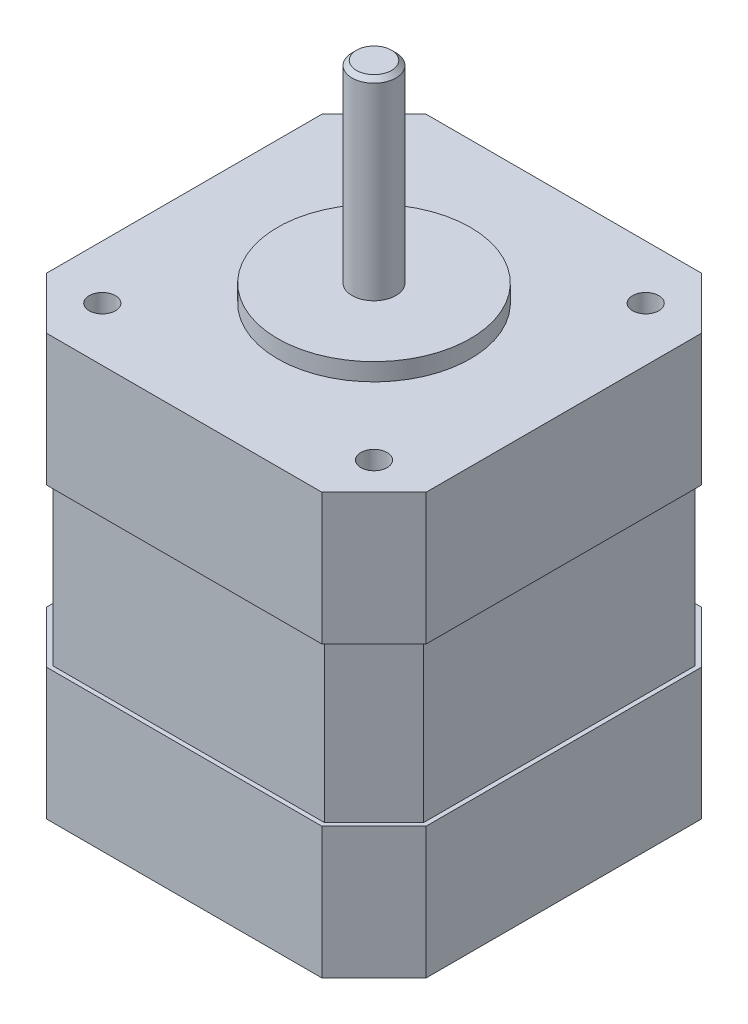
ISO-10303-21;
HEADER;
FILE_DESCRIPTION(('STEP AP214'),'2;1');
FILE_NAME('part.step','',(''),(''),'','','');
FILE_SCHEMA(('AUTOMOTIVE_DESIGN { 1 0 10303 214 1 1 1 1 }'));
ENDSEC;
DATA;
#1=APPLICATION_CONTEXT('core data for automotive mechanical design processes');
#2=APPLICATION_PROTOCOL_DEFINITION('international standard','automotive_design',2000,#1);
#3=PRODUCT_CONTEXT('',#1,'mechanical');
#4=PRODUCT('Part','Part','',(#3));
#5=PRODUCT_RELATED_PRODUCT_CATEGORY('part','',(#4));
#6=PRODUCT_DEFINITION_FORMATION('','',#4);
#7=PRODUCT_DEFINITION_CONTEXT('part definition',#1,'design');
#8=PRODUCT_DEFINITION('design','',#6,#7);
#9=PRODUCT_DEFINITION_SHAPE('','',#8);
#10=(LENGTH_UNIT() NAMED_UNIT(*) SI_UNIT(.MILLI.,.METRE.));
#11=(NAMED_UNIT(*) PLANE_ANGLE_UNIT() SI_UNIT($,.RADIAN.));
#12=(NAMED_UNIT(*) SI_UNIT($,.STERADIAN.) SOLID_ANGLE_UNIT());
#13=UNCERTAINTY_MEASURE_WITH_UNIT(LENGTH_MEASURE(1.E-05),#10,'distance_accuracy_value','');
#14=(GEOMETRIC_REPRESENTATION_CONTEXT(3) GLOBAL_UNCERTAINTY_ASSIGNED_CONTEXT((#13)) GLOBAL_UNIT_ASSIGNED_CONTEXT((#10,
#11,#12)) REPRESENTATION_CONTEXT('',''));
#15=CARTESIAN_POINT('',(0.,0.,0.));
#16=DIRECTION('',(0.,0.,1.));
#17=DIRECTION('',(1.,0.,0.));
#18=AXIS2_PLACEMENT_3D('',#15,#16,#17);
#19=CARTESIAN_POINT('',(-21.15,48.,15.5));
#20=DIRECTION('',(-1.,0.,0.));
#21=DIRECTION('',(0.,0.,1.));
#22=AXIS2_PLACEMENT_3D('',#19,#20,#21);
#23=PLANE('',#22);
#24=DIRECTION('',(0.,-1.,0.));
#25=VECTOR('',#24,1.);
#26=CARTESIAN_POINT('',(-21.15,48.,-15.5));
#27=LINE('',#26,#25);
#28=CARTESIAN_POINT('',(-21.15,33.,-15.5));
#29=VERTEX_POINT('',#28);
#30=CARTESIAN_POINT('',(-21.15,15.,-15.5));
#31=VERTEX_POINT('',#30);
#32=EDGE_CURVE('E215',#29,#31,#27,.T.);
#33=ORIENTED_EDGE('',*,*,#32,.T.);
#34=DIRECTION('',(0.,0.,1.));
#35=VECTOR('',#34,1.);
#36=CARTESIAN_POINT('',(-21.15,15.,-15.5));
#37=LINE('',#36,#35);
#38=CARTESIAN_POINT('',(-21.15,15.,15.5));
#39=VERTEX_POINT('',#38);
#40=EDGE_CURVE('E219',#31,#39,#37,.T.);
#41=ORIENTED_EDGE('',*,*,#40,.T.);
#42=DIRECTION('',(0.,-1.,0.));
#43=VECTOR('',#42,1.);
#44=CARTESIAN_POINT('',(-21.15,48.,15.5));
#45=LINE('',#44,#43);
#46=CARTESIAN_POINT('',(-21.15,33.,15.5));
#47=VERTEX_POINT('',#46);
#48=EDGE_CURVE('E205',#47,#39,#45,.T.);
#49=ORIENTED_EDGE('',*,*,#48,.F.);
#50=DIRECTION('',(0.,0.,1.));
#51=VECTOR('',#50,1.);
#52=CARTESIAN_POINT('',(-21.15,33.,-15.5));
#53=LINE('',#52,#51);
#54=EDGE_CURVE('E269',#29,#47,#53,.T.);
#55=ORIENTED_EDGE('',*,*,#54,.F.);
#56=EDGE_LOOP('',(#33,#41,#49,#55));
#57=FACE_BOUND('',#56,.T.);
#58=ADVANCED_FACE('F41',(#57),#23,.T.);
#59=CARTESIAN_POINT('',(-15.5,48.,-21.15));
#60=DIRECTION('',(0.707106781186545,0.,0.70710678118655));
#61=DIRECTION('',(0.70710678118655,0.,-0.707106781186545));
#62=AXIS2_PLACEMENT_3D('',#59,#60,#61);
#63=PLANE('',#62);
#64=DIRECTION('',(-0.70710678118655,0.,0.707106781186545));
#65=VECTOR('',#64,1.);
#66=CARTESIAN_POINT('',(-15.5,15.,-21.15));
#67=LINE('',#66,#65);
#68=CARTESIAN_POINT('',(-15.5,15.,-21.15));
#69=VERTEX_POINT('',#68);
#70=EDGE_CURVE('E56',#69,#31,#67,.T.);
#71=ORIENTED_EDGE('',*,*,#70,.T.);
#72=ORIENTED_EDGE('',*,*,#32,.F.);
#73=DIRECTION('',(-0.70710678118655,0.,0.707106781186545));
#74=VECTOR('',#73,1.);
#75=CARTESIAN_POINT('',(-15.5,33.,-21.15));
#76=LINE('',#75,#74);
#77=CARTESIAN_POINT('',(-15.5,33.,-21.15));
#78=VERTEX_POINT('',#77);
#79=EDGE_CURVE('E302',#78,#29,#76,.T.);
#80=ORIENTED_EDGE('',*,*,#79,.F.);
#81=DIRECTION('',(0.,-1.,0.));
#82=VECTOR('',#81,1.);
#83=CARTESIAN_POINT('',(-15.5,48.,-21.15));
#84=LINE('',#83,#82);
#85=EDGE_CURVE('E398',#78,#69,#84,.T.);
#86=ORIENTED_EDGE('',*,*,#85,.T.);
#87=EDGE_LOOP('',(#71,#72,#80,#86));
#88=FACE_BOUND('',#87,.T.);
#89=ADVANCED_FACE('F434',(#88),#63,.F.);
#90=CARTESIAN_POINT('',(-15.5,48.,-21.15));
#91=DIRECTION('',(0.,0.,-1.));
#92=DIRECTION('',(-1.,0.,0.));
#93=AXIS2_PLACEMENT_3D('',#90,#91,#92);
#94=PLANE('',#93);
#95=DIRECTION('',(0.,-1.,0.));
#96=VECTOR('',#95,1.);
#97=CARTESIAN_POINT('',(15.5,48.,-21.15));
#98=LINE('',#97,#96);
#99=CARTESIAN_POINT('',(15.5,33.,-21.15));
#100=VERTEX_POINT('',#99);
#101=CARTESIAN_POINT('',(15.5,15.,-21.15));
#102=VERTEX_POINT('',#101);
#103=EDGE_CURVE('E400',#100,#102,#98,.T.);
#104=ORIENTED_EDGE('',*,*,#103,.T.);
#105=DIRECTION('',(-1.,0.,0.));
#106=VECTOR('',#105,1.);
#107=CARTESIAN_POINT('',(15.5,15.,-21.15));
#108=LINE('',#107,#106);
#109=EDGE_CURVE('E64',#102,#69,#108,.T.);
#110=ORIENTED_EDGE('',*,*,#109,.T.);
#111=ORIENTED_EDGE('',*,*,#85,.F.);
#112=DIRECTION('',(-1.,0.,0.));
#113=VECTOR('',#112,1.);
#114=CARTESIAN_POINT('',(15.5,33.,-21.15));
#115=LINE('',#114,#113);
#116=EDGE_CURVE('E300',#100,#78,#115,.T.);
#117=ORIENTED_EDGE('',*,*,#116,.F.);
#118=EDGE_LOOP('',(#104,#110,#111,#117));
#119=FACE_BOUND('',#118,.T.);
#120=ADVANCED_FACE('F439',(#119),#94,.T.);
#121=CARTESIAN_POINT('',(15.5,48.,-21.15));
#122=DIRECTION('',(0.707106781186549,0.,-0.707106781186546));
#123=DIRECTION('',(-0.707106781186546,0.,-0.707106781186549));
#124=AXIS2_PLACEMENT_3D('',#121,#122,#123);
#125=PLANE('',#124);
#126=DIRECTION('',(0.,-1.,0.));
#127=VECTOR('',#126,1.);
#128=CARTESIAN_POINT('',(21.15,48.,-15.5));
#129=LINE('',#128,#127);
#130=CARTESIAN_POINT('',(21.15,33.,-15.5));
#131=VERTEX_POINT('',#130);
#132=CARTESIAN_POINT('',(21.15,15.,-15.5));
#133=VERTEX_POINT('',#132);
#134=EDGE_CURVE('E402',#131,#133,#129,.T.);
#135=ORIENTED_EDGE('',*,*,#134,.T.);
#136=DIRECTION('',(-0.707106781186546,0.,-0.707106781186549));
#137=VECTOR('',#136,1.);
#138=CARTESIAN_POINT('',(21.15,15.,-15.5));
#139=LINE('',#138,#137);
#140=EDGE_CURVE('E929',#133,#102,#139,.T.);
#141=ORIENTED_EDGE('',*,*,#140,.T.);
#142=ORIENTED_EDGE('',*,*,#103,.F.);
#143=DIRECTION('',(-0.707106781186546,0.,-0.707106781186549));
#144=VECTOR('',#143,1.);
#145=CARTESIAN_POINT('',(21.15,33.,-15.5));
#146=LINE('',#145,#144);
#147=EDGE_CURVE('E298',#131,#100,#146,.T.);
#148=ORIENTED_EDGE('',*,*,#147,.F.);
#149=EDGE_LOOP('',(#135,#141,#142,#148));
#150=FACE_BOUND('',#149,.T.);
#151=ADVANCED_FACE('F447',(#150),#125,.T.);
#152=CARTESIAN_POINT('',(21.15,48.,15.5));
#153=DIRECTION('',(-1.,0.,0.));
#154=DIRECTION('',(0.,0.,1.));
#155=AXIS2_PLACEMENT_3D('',#152,#153,#154);
#156=PLANE('',#155);
#157=DIRECTION('',(0.,0.,-1.));
#158=VECTOR('',#157,1.);
#159=CARTESIAN_POINT('',(21.15,15.,15.5));
#160=LINE('',#159,#158);
#161=CARTESIAN_POINT('',(21.15,15.,15.5));
#162=VERTEX_POINT('',#161);
#163=EDGE_CURVE('E931',#162,#133,#160,.T.);
#164=ORIENTED_EDGE('',*,*,#163,.T.);
#165=ORIENTED_EDGE('',*,*,#134,.F.);
#166=DIRECTION('',(0.,0.,-1.));
#167=VECTOR('',#166,1.);
#168=CARTESIAN_POINT('',(21.15,33.,15.5));
#169=LINE('',#168,#167);
#170=CARTESIAN_POINT('',(21.15,33.,15.5));
#171=VERTEX_POINT('',#170);
#172=EDGE_CURVE('E296',#171,#131,#169,.T.);
#173=ORIENTED_EDGE('',*,*,#172,.F.);
#174=DIRECTION('',(0.,-1.,0.));
#175=VECTOR('',#174,1.);
#176=CARTESIAN_POINT('',(21.15,48.,15.5));
#177=LINE('',#176,#175);
#178=EDGE_CURVE('E405',#171,#162,#177,.T.);
#179=ORIENTED_EDGE('',*,*,#178,.T.);
#180=EDGE_LOOP('',(#164,#165,#173,#179));
#181=FACE_BOUND('',#180,.T.);
#182=ADVANCED_FACE('F450',(#181),#156,.F.);
#183=CARTESIAN_POINT('',(21.15,48.,15.5));
#184=DIRECTION('',(0.707106781186545,0.,0.70710678118655));
#185=DIRECTION('',(0.70710678118655,0.,-0.707106781186545));
#186=AXIS2_PLACEMENT_3D('',#183,#184,#185);
#187=PLANE('',#186);
#188=DIRECTION('',(0.,-1.,0.));
#189=VECTOR('',#188,1.);
#190=CARTESIAN_POINT('',(15.5,48.,21.15));
#191=LINE('',#190,#189);
#192=CARTESIAN_POINT('',(15.5,33.,21.15));
#193=VERTEX_POINT('',#192);
#194=CARTESIAN_POINT('',(15.5,15.,21.15));
#195=VERTEX_POINT('',#194);
#196=EDGE_CURVE('E408',#193,#195,#191,.T.);
#197=ORIENTED_EDGE('',*,*,#196,.T.);
#198=DIRECTION('',(0.70710678118655,0.,-0.707106781186545));
#199=VECTOR('',#198,1.);
#200=CARTESIAN_POINT('',(15.5,15.,21.15));
#201=LINE('',#200,#199);
#202=EDGE_CURVE('E231',#195,#162,#201,.T.);
#203=ORIENTED_EDGE('',*,*,#202,.T.);
#204=ORIENTED_EDGE('',*,*,#178,.F.);
#205=DIRECTION('',(0.70710678118655,0.,-0.707106781186545));
#206=VECTOR('',#205,1.);
#207=CARTESIAN_POINT('',(15.5,33.,21.15));
#208=LINE('',#207,#206);
#209=EDGE_CURVE('E294',#193,#171,#208,.T.);
#210=ORIENTED_EDGE('',*,*,#209,.F.);
#211=EDGE_LOOP('',(#197,#203,#204,#210));
#212=FACE_BOUND('',#211,.T.);
#213=ADVANCED_FACE('F454',(#212),#187,.T.);
#214=CARTESIAN_POINT('',(-15.5,48.,21.15));
#215=DIRECTION('',(0.,0.,-1.));
#216=DIRECTION('',(-1.,0.,0.));
#217=AXIS2_PLACEMENT_3D('',#214,#215,#216);
#218=PLANE('',#217);
#219=DIRECTION('',(1.,0.,0.));
#220=VECTOR('',#219,1.);
#221=CARTESIAN_POINT('',(-15.5,15.,21.15));
#222=LINE('',#221,#220);
#223=CARTESIAN_POINT('',(-15.5,15.,21.15));
#224=VERTEX_POINT('',#223);
#225=EDGE_CURVE('E225',#224,#195,#222,.T.);
#226=ORIENTED_EDGE('',*,*,#225,.T.);
#227=ORIENTED_EDGE('',*,*,#196,.F.);
#228=DIRECTION('',(1.,0.,0.));
#229=VECTOR('',#228,1.);
#230=CARTESIAN_POINT('',(-15.5,33.,21.15));
#231=LINE('',#230,#229);
#232=CARTESIAN_POINT('',(-15.5,33.,21.15));
#233=VERTEX_POINT('',#232);
#234=EDGE_CURVE('E292',#233,#193,#231,.T.);
#235=ORIENTED_EDGE('',*,*,#234,.F.);
#236=DIRECTION('',(0.,-1.,0.));
#237=VECTOR('',#236,1.);
#238=CARTESIAN_POINT('',(-15.5,48.,21.15));
#239=LINE('',#238,#237);
#240=EDGE_CURVE('E411',#233,#224,#239,.T.);
#241=ORIENTED_EDGE('',*,*,#240,.T.);
#242=EDGE_LOOP('',(#226,#227,#235,#241));
#243=FACE_BOUND('',#242,.T.);
#244=ADVANCED_FACE('F458',(#243),#218,.F.);
#245=CARTESIAN_POINT('',(-21.15,48.,15.5));
#246=DIRECTION('',(0.707106781186548,0.,-0.707106781186546));
#247=DIRECTION('',(-0.707106781186546,0.,-0.707106781186549));
#248=AXIS2_PLACEMENT_3D('',#245,#246,#247);
#249=PLANE('',#248);
#250=DIRECTION('',(0.707106781186546,0.,0.707106781186549));
#251=VECTOR('',#250,1.);
#252=CARTESIAN_POINT('',(-21.15,15.,15.5));
#253=LINE('',#252,#251);
#254=EDGE_CURVE('E210',#39,#224,#253,.T.);
#255=ORIENTED_EDGE('',*,*,#254,.T.);
#256=ORIENTED_EDGE('',*,*,#240,.F.);
#257=DIRECTION('',(0.707106781186546,0.,0.707106781186549));
#258=VECTOR('',#257,1.);
#259=CARTESIAN_POINT('',(-21.15,33.,15.5));
#260=LINE('',#259,#258);
#261=EDGE_CURVE('E212',#47,#233,#260,.T.);
#262=ORIENTED_EDGE('',*,*,#261,.F.);
#263=ORIENTED_EDGE('',*,*,#48,.T.);
#264=EDGE_LOOP('',(#255,#256,#262,#263));
#265=FACE_BOUND('',#264,.T.);
#266=ADVANCED_FACE('F207',(#265),#249,.F.);
#267=CARTESIAN_POINT('',(0.,48.,0.));
#268=DIRECTION('',(0.,-1.,0.));
#269=DIRECTION('',(0.,0.,-1.));
#270=AXIS2_PLACEMENT_3D('',#267,#268,#269);
#271=PLANE('',#270);
#272=CARTESIAN_POINT('',(-15.4999999999991,48.,15.5));
#273=DIRECTION('',(0.,1.,0.));
#274=DIRECTION('',(0.,0.,1.));
#275=AXIS2_PLACEMENT_3D('',#272,#273,#274);
#276=CIRCLE('',#275,1.50000000000046);
#277=CARTESIAN_POINT('',(-15.4999999999991,48.,17.0000000000004));
#278=VERTEX_POINT('',#277);
#279=EDGE_CURVE('E355',#278,#278,#276,.T.);
#280=ORIENTED_EDGE('',*,*,#279,.F.);
#281=EDGE_LOOP('',(#280));
#282=FACE_BOUND('',#281,.T.);
#283=CARTESIAN_POINT('',(15.5000000000008,48.,15.4999999999991));
#284=DIRECTION('',(0.,1.,0.));
#285=DIRECTION('',(0.,0.,1.));
#286=AXIS2_PLACEMENT_3D('',#283,#284,#285);
#287=CIRCLE('',#286,1.50000000000122);
#288=CARTESIAN_POINT('',(15.5000000000008,48.,17.0000000000003));
#289=VERTEX_POINT('',#288);
#290=EDGE_CURVE('E372',#289,#289,#287,.T.);
#291=ORIENTED_EDGE('',*,*,#290,.F.);
#292=EDGE_LOOP('',(#291));
#293=FACE_BOUND('',#292,.T.);
#294=CARTESIAN_POINT('',(15.5,48.,-15.5000000000008));
#295=DIRECTION('',(0.,1.,0.));
#296=DIRECTION('',(0.,0.,1.));
#297=AXIS2_PLACEMENT_3D('',#294,#295,#296);
#298=CIRCLE('',#297,1.50000000000089);
#299=CARTESIAN_POINT('',(15.5,48.,-14.));
#300=VERTEX_POINT('',#299);
#301=EDGE_CURVE('E378',#300,#300,#298,.T.);
#302=ORIENTED_EDGE('',*,*,#301,.F.);
#303=EDGE_LOOP('',(#302));
#304=FACE_BOUND('',#303,.T.);
#305=CARTESIAN_POINT('',(-15.5,48.,-15.5));
#306=DIRECTION('',(0.,1.,0.));
#307=DIRECTION('',(0.,0.,1.));
#308=AXIS2_PLACEMENT_3D('',#305,#306,#307);
#309=CIRCLE('',#308,1.5);
#310=CARTESIAN_POINT('',(-15.5,48.,-14.));
#311=VERTEX_POINT('',#310);
#312=EDGE_CURVE('E384',#311,#311,#309,.T.);
#313=ORIENTED_EDGE('',*,*,#312,.F.);
#314=EDGE_LOOP('',(#313));
#315=FACE_BOUND('',#314,.T.);
#316=CARTESIAN_POINT('',(0.,48.,0.));
#317=DIRECTION('',(0.,-1.,0.));
#318=DIRECTION('',(0.,0.,-1.));
#319=AXIS2_PLACEMENT_3D('',#316,#317,#318);
#320=CIRCLE('',#319,11.);
#321=CARTESIAN_POINT('',(0.,48.,-11.));
#322=VERTEX_POINT('',#321);
#323=EDGE_CURVE('E413',#322,#322,#320,.F.);
#324=ORIENTED_EDGE('',*,*,#323,.F.);
#325=EDGE_LOOP('',(#324));
#326=FACE_BOUND('',#325,.T.);
#327=DIRECTION('',(0.,0.,1.));
#328=VECTOR('',#327,1.);
#329=CARTESIAN_POINT('',(-21.65,48.,-15.7071067811866));
#330=LINE('',#329,#328);
#331=CARTESIAN_POINT('',(-21.65,48.,-15.7071067811866));
#332=VERTEX_POINT('',#331);
#333=CARTESIAN_POINT('',(-21.65,48.,15.7071067811865));
#334=VERTEX_POINT('',#333);
#335=EDGE_CURVE('E304',#332,#334,#330,.T.);
#336=ORIENTED_EDGE('',*,*,#335,.T.);
#337=DIRECTION('',(0.707106781186546,0.,0.707106781186549));
#338=VECTOR('',#337,1.);
#339=CARTESIAN_POINT('',(-21.65,48.,15.7071067811865));
#340=LINE('',#339,#338);
#341=CARTESIAN_POINT('',(-15.7071067811866,48.,21.65));
#342=VERTEX_POINT('',#341);
#343=EDGE_CURVE('E333',#334,#342,#340,.T.);
#344=ORIENTED_EDGE('',*,*,#343,.T.);
#345=DIRECTION('',(1.,0.,0.));
#346=VECTOR('',#345,1.);
#347=CARTESIAN_POINT('',(-15.7071067811866,48.,21.65));
#348=LINE('',#347,#346);
#349=CARTESIAN_POINT('',(15.7071067811865,48.,21.65));
#350=VERTEX_POINT('',#349);
#351=EDGE_CURVE('E336',#342,#350,#348,.T.);
#352=ORIENTED_EDGE('',*,*,#351,.T.);
#353=DIRECTION('',(0.70710678118655,0.,-0.707106781186545));
#354=VECTOR('',#353,1.);
#355=CARTESIAN_POINT('',(15.7071067811865,48.,21.65));
#356=LINE('',#355,#354);
#357=CARTESIAN_POINT('',(21.65,48.,15.7071067811866));
#358=VERTEX_POINT('',#357);
#359=EDGE_CURVE('E339',#350,#358,#356,.T.);
#360=ORIENTED_EDGE('',*,*,#359,.T.);
#361=DIRECTION('',(0.,0.,-1.));
#362=VECTOR('',#361,1.);
#363=CARTESIAN_POINT('',(21.65,48.,15.7071067811866));
#364=LINE('',#363,#362);
#365=CARTESIAN_POINT('',(21.65,48.,-15.7071067811865));
#366=VERTEX_POINT('',#365);
#367=EDGE_CURVE('E342',#358,#366,#364,.T.);
#368=ORIENTED_EDGE('',*,*,#367,.T.);
#369=DIRECTION('',(-0.707106781186546,0.,-0.707106781186549));
#370=VECTOR('',#369,1.);
#371=CARTESIAN_POINT('',(21.65,48.,-15.7071067811865));
#372=LINE('',#371,#370);
#373=CARTESIAN_POINT('',(15.7071067811866,48.,-21.65));
#374=VERTEX_POINT('',#373);
#375=EDGE_CURVE('E345',#366,#374,#372,.T.);
#376=ORIENTED_EDGE('',*,*,#375,.T.);
#377=DIRECTION('',(-1.,0.,0.));
#378=VECTOR('',#377,1.);
#379=CARTESIAN_POINT('',(15.7071067811866,48.,-21.65));
#380=LINE('',#379,#378);
#381=CARTESIAN_POINT('',(-15.7071067811865,48.,-21.65));
#382=VERTEX_POINT('',#381);
#383=EDGE_CURVE('E348',#374,#382,#380,.T.);
#384=ORIENTED_EDGE('',*,*,#383,.T.);
#385=DIRECTION('',(-0.70710678118655,0.,0.707106781186545));
#386=VECTOR('',#385,1.);
#387=CARTESIAN_POINT('',(-15.7071067811865,48.,-21.65));
#388=LINE('',#387,#386);
#389=EDGE_CURVE('E309',#382,#332,#388,.T.);
#390=ORIENTED_EDGE('',*,*,#389,.T.);
#391=EDGE_LOOP('',(#336,#344,#352,#360,#368,#376,#384,#390));
#392=FACE_BOUND('',#391,.T.);
#393=ADVANCED_FACE('F463',(#282,#293,#304,#315,#326,#392),#271,.F.);
#394=CARTESIAN_POINT('',(0.,50.,0.));
#395=DIRECTION('',(0.,-1.,0.));
#396=DIRECTION('',(0.,0.,-1.));
#397=AXIS2_PLACEMENT_3D('',#394,#395,#396);
#398=CYLINDRICAL_SURFACE('',#397,11.);
#399=CARTESIAN_POINT('',(0.,50.,0.));
#400=DIRECTION('',(0.,1.,0.));
#401=DIRECTION('',(0.,0.,1.));
#402=AXIS2_PLACEMENT_3D('',#399,#400,#401);
#403=CIRCLE('',#402,11.);
#404=CARTESIAN_POINT('',(0.,50.,11.));
#405=VERTEX_POINT('',#404);
#406=EDGE_CURVE('E216',#405,#405,#403,.T.);
#407=ORIENTED_EDGE('',*,*,#406,.F.);
#408=EDGE_LOOP('',(#407));
#409=FACE_BOUND('',#408,.T.);
#410=ORIENTED_EDGE('',*,*,#323,.T.);
#411=EDGE_LOOP('',(#410));
#412=FACE_BOUND('',#411,.T.);
#413=ADVANCED_FACE('F467',(#409,#412),#398,.T.);
#414=CARTESIAN_POINT('',(0.,50.,0.));
#415=DIRECTION('',(0.,1.,0.));
#416=DIRECTION('',(0.,0.,1.));
#417=AXIS2_PLACEMENT_3D('',#414,#415,#416);
#418=PLANE('',#417);
#419=CARTESIAN_POINT('',(0.,50.,0.));
#420=DIRECTION('',(0.,1.,0.));
#421=DIRECTION('',(0.,0.,1.));
#422=AXIS2_PLACEMENT_3D('',#419,#420,#421);
#423=CIRCLE('',#422,2.5);
#424=CARTESIAN_POINT('',(0.,50.,2.5));
#425=VERTEX_POINT('',#424);
#426=EDGE_CURVE('E390',#425,#425,#423,.T.);
#427=ORIENTED_EDGE('',*,*,#426,.F.);
#428=EDGE_LOOP('',(#427));
#429=FACE_BOUND('',#428,.T.);
#430=ORIENTED_EDGE('',*,*,#406,.T.);
#431=EDGE_LOOP('',(#430));
#432=FACE_BOUND('',#431,.T.);
#433=ADVANCED_FACE('F472',(#429,#432),#418,.T.);
#434=CARTESIAN_POINT('',(0.,72.,0.));
#435=DIRECTION('',(0.,-1.,0.));
#436=DIRECTION('',(0.,0.,-1.));
#437=AXIS2_PLACEMENT_3D('',#434,#435,#436);
#438=CYLINDRICAL_SURFACE('',#437,2.5);
#439=CARTESIAN_POINT('',(0.,71.5,0.));
#440=DIRECTION('',(0.,1.,0.));
#441=DIRECTION('',(0.,0.,1.));
#442=AXIS2_PLACEMENT_3D('',#439,#440,#441);
#443=CIRCLE('',#442,2.5);
#444=CARTESIAN_POINT('',(0.,71.5,2.5));
#445=VERTEX_POINT('',#444);
#446=EDGE_CURVE('E11',#445,#445,#443,.F.);
#447=ORIENTED_EDGE('',*,*,#446,.T.);
#448=EDGE_LOOP('',(#447));
#449=FACE_BOUND('',#448,.T.);
#450=ORIENTED_EDGE('',*,*,#426,.T.);
#451=EDGE_LOOP('',(#450));
#452=FACE_BOUND('',#451,.T.);
#453=ADVANCED_FACE('F430',(#449,#452),#438,.T.);
#454=CARTESIAN_POINT('',(0.,72.,0.));
#455=DIRECTION('',(0.,1.,0.));
#456=DIRECTION('',(0.,0.,1.));
#457=AXIS2_PLACEMENT_3D('',#454,#455,#456);
#458=PLANE('',#457);
#459=CARTESIAN_POINT('',(0.,72.,0.));
#460=DIRECTION('',(0.,1.,0.));
#461=DIRECTION('',(0.,0.,1.));
#462=AXIS2_PLACEMENT_3D('',#459,#460,#461);
#463=CIRCLE('',#462,1.99999999999999);
#464=CARTESIAN_POINT('',(0.,72.,1.99999999999999));
#465=VERTEX_POINT('',#464);
#466=EDGE_CURVE('E49',#465,#465,#463,.T.);
#467=ORIENTED_EDGE('',*,*,#466,.T.);
#468=EDGE_LOOP('',(#467));
#469=FACE_BOUND('',#468,.T.);
#470=ADVANCED_FACE('F418',(#469),#458,.T.);
#471=CARTESIAN_POINT('',(0.,72.,0.));
#472=DIRECTION('',(0.,-1.,0.));
#473=DIRECTION('',(0.,0.,-1.));
#474=AXIS2_PLACEMENT_3D('',#471,#472,#473);
#475=CONICAL_SURFACE('',#474,1.99999999999999,0.78539816339746);
#476=ORIENTED_EDGE('',*,*,#446,.F.);
#477=EDGE_LOOP('',(#476));
#478=FACE_BOUND('',#477,.T.);
#479=ORIENTED_EDGE('',*,*,#466,.F.);
#480=EDGE_LOOP('',(#479));
#481=FACE_BOUND('',#480,.T.);
#482=ADVANCED_FACE('F43',(#478,#481),#475,.T.);
#483=CARTESIAN_POINT('',(-15.5,38.,-15.5));
#484=DIRECTION('',(0.,1.,0.));
#485=DIRECTION('',(0.,0.,1.));
#486=AXIS2_PLACEMENT_3D('',#483,#484,#485);
#487=CYLINDRICAL_SURFACE('',#486,1.5);
#488=CARTESIAN_POINT('',(-15.5,38.,-15.5));
#489=DIRECTION('',(0.,1.,0.));
#490=DIRECTION('',(0.,0.,1.));
#491=AXIS2_PLACEMENT_3D('',#488,#489,#490);
#492=CIRCLE('',#491,1.5);
#493=CARTESIAN_POINT('',(-15.5,38.,-14.));
#494=VERTEX_POINT('',#493);
#495=EDGE_CURVE('E387',#494,#494,#492,.T.);
#496=ORIENTED_EDGE('',*,*,#495,.F.);
#497=EDGE_LOOP('',(#496));
#498=FACE_BOUND('',#497,.T.);
#499=ORIENTED_EDGE('',*,*,#312,.T.);
#500=EDGE_LOOP('',(#499));
#501=FACE_BOUND('',#500,.T.);
#502=ADVANCED_FACE('F421',(#498,#501),#487,.F.);
#503=CARTESIAN_POINT('',(-15.5,38.,-15.5));
#504=DIRECTION('',(0.,1.,0.));
#505=DIRECTION('',(0.,0.,1.));
#506=AXIS2_PLACEMENT_3D('',#503,#504,#505);
#507=PLANE('',#506);
#508=ORIENTED_EDGE('',*,*,#495,.T.);
#509=EDGE_LOOP('',(#508));
#510=FACE_BOUND('',#509,.T.);
#511=ADVANCED_FACE('F427',(#510),#507,.T.);
#512=CARTESIAN_POINT('',(15.5,38.,-15.5000000000008));
#513=DIRECTION('',(0.,1.,0.));
#514=DIRECTION('',(0.,0.,1.));
#515=AXIS2_PLACEMENT_3D('',#512,#513,#514);
#516=CYLINDRICAL_SURFACE('',#515,1.50000000000089);
#517=CARTESIAN_POINT('',(15.5,38.,-15.5000000000008));
#518=DIRECTION('',(0.,1.,0.));
#519=DIRECTION('',(0.,0.,1.));
#520=AXIS2_PLACEMENT_3D('',#517,#518,#519);
#521=CIRCLE('',#520,1.50000000000089);
#522=CARTESIAN_POINT('',(15.5,38.,-14.));
#523=VERTEX_POINT('',#522);
#524=EDGE_CURVE('E381',#523,#523,#521,.T.);
#525=ORIENTED_EDGE('',*,*,#524,.F.);
#526=EDGE_LOOP('',(#525));
#527=FACE_BOUND('',#526,.T.);
#528=ORIENTED_EDGE('',*,*,#301,.T.);
#529=EDGE_LOOP('',(#528));
#530=FACE_BOUND('',#529,.T.);
#531=ADVANCED_FACE('F486',(#527,#530),#516,.F.);
#532=CARTESIAN_POINT('',(15.5,38.,-15.5000000000008));
#533=DIRECTION('',(0.,1.,0.));
#534=DIRECTION('',(0.,0.,1.));
#535=AXIS2_PLACEMENT_3D('',#532,#533,#534);
#536=PLANE('',#535);
#537=ORIENTED_EDGE('',*,*,#524,.T.);
#538=EDGE_LOOP('',(#537));
#539=FACE_BOUND('',#538,.T.);
#540=ADVANCED_FACE('F490',(#539),#536,.T.);
#541=CARTESIAN_POINT('',(15.5000000000008,38.,15.4999999999991));
#542=DIRECTION('',(0.,1.,0.));
#543=DIRECTION('',(0.,0.,1.));
#544=AXIS2_PLACEMENT_3D('',#541,#542,#543);
#545=CYLINDRICAL_SURFACE('',#544,1.50000000000122);
#546=CARTESIAN_POINT('',(15.5000000000008,38.,15.4999999999991));
#547=DIRECTION('',(0.,1.,0.));
#548=DIRECTION('',(0.,0.,1.));
#549=AXIS2_PLACEMENT_3D('',#546,#547,#548);
#550=CIRCLE('',#549,1.50000000000122);
#551=CARTESIAN_POINT('',(15.5000000000008,38.,17.0000000000003));
#552=VERTEX_POINT('',#551);
#553=EDGE_CURVE('E375',#552,#552,#550,.T.);
#554=ORIENTED_EDGE('',*,*,#553,.F.);
#555=EDGE_LOOP('',(#554));
#556=FACE_BOUND('',#555,.T.);
#557=ORIENTED_EDGE('',*,*,#290,.T.);
#558=EDGE_LOOP('',(#557));
#559=FACE_BOUND('',#558,.T.);
#560=ADVANCED_FACE('F494',(#556,#559),#545,.F.);
#561=CARTESIAN_POINT('',(15.5000000000008,38.,15.4999999999991));
#562=DIRECTION('',(0.,1.,0.));
#563=DIRECTION('',(0.,0.,1.));
#564=AXIS2_PLACEMENT_3D('',#561,#562,#563);
#565=PLANE('',#564);
#566=ORIENTED_EDGE('',*,*,#553,.T.);
#567=EDGE_LOOP('',(#566));
#568=FACE_BOUND('',#567,.T.);
#569=ADVANCED_FACE('F498',(#568),#565,.T.);
#570=CARTESIAN_POINT('',(-15.4999999999991,38.,15.5));
#571=DIRECTION('',(0.,1.,0.));
#572=DIRECTION('',(0.,0.,1.));
#573=AXIS2_PLACEMENT_3D('',#570,#571,#572);
#574=CYLINDRICAL_SURFACE('',#573,1.50000000000046);
#575=CARTESIAN_POINT('',(-15.4999999999991,38.,15.5));
#576=DIRECTION('',(0.,1.,0.));
#577=DIRECTION('',(0.,0.,1.));
#578=AXIS2_PLACEMENT_3D('',#575,#576,#577);
#579=CIRCLE('',#578,1.50000000000046);
#580=CARTESIAN_POINT('',(-15.4999999999991,38.,17.0000000000004));
#581=VERTEX_POINT('',#580);
#582=EDGE_CURVE('E369',#581,#581,#579,.T.);
#583=ORIENTED_EDGE('',*,*,#582,.F.);
#584=EDGE_LOOP('',(#583));
#585=FACE_BOUND('',#584,.T.);
#586=ORIENTED_EDGE('',*,*,#279,.T.);
#587=EDGE_LOOP('',(#586));
#588=FACE_BOUND('',#587,.T.);
#589=ADVANCED_FACE('F502',(#585,#588),#574,.F.);
#590=CARTESIAN_POINT('',(-15.4999999999991,38.,15.5));
#591=DIRECTION('',(0.,1.,0.));
#592=DIRECTION('',(0.,0.,1.));
#593=AXIS2_PLACEMENT_3D('',#590,#591,#592);
#594=PLANE('',#593);
#595=ORIENTED_EDGE('',*,*,#582,.T.);
#596=EDGE_LOOP('',(#595));
#597=FACE_BOUND('',#596,.T.);
#598=ADVANCED_FACE('F506',(#597),#594,.T.);
#599=CARTESIAN_POINT('',(-21.65,33.,-15.7071067811866));
#600=DIRECTION('',(-1.,0.,0.));
#601=DIRECTION('',(0.,0.,1.));
#602=AXIS2_PLACEMENT_3D('',#599,#600,#601);
#603=PLANE('',#602);
#604=ORIENTED_EDGE('',*,*,#335,.F.);
#605=DIRECTION('',(0.,1.,0.));
#606=VECTOR('',#605,1.);
#607=CARTESIAN_POINT('',(-21.65,33.,-15.7071067811866));
#608=LINE('',#607,#606);
#609=CARTESIAN_POINT('',(-21.65,33.,-15.7071067811866));
#610=VERTEX_POINT('',#609);
#611=EDGE_CURVE('E353',#610,#332,#608,.T.);
#612=ORIENTED_EDGE('',*,*,#611,.F.);
#613=DIRECTION('',(0.,0.,1.));
#614=VECTOR('',#613,1.);
#615=CARTESIAN_POINT('',(-21.65,33.,-15.7071067811866));
#616=LINE('',#615,#614);
#617=CARTESIAN_POINT('',(-21.65,33.,15.7071067811865));
#618=VERTEX_POINT('',#617);
#619=EDGE_CURVE('E305',#610,#618,#616,.T.);
#620=ORIENTED_EDGE('',*,*,#619,.T.);
#621=DIRECTION('',(0.,1.,0.));
#622=VECTOR('',#621,1.);
#623=CARTESIAN_POINT('',(-21.65,33.,15.7071067811865));
#624=LINE('',#623,#622);
#625=EDGE_CURVE('E330',#618,#334,#624,.T.);
#626=ORIENTED_EDGE('',*,*,#625,.T.);
#627=EDGE_LOOP('',(#604,#612,#620,#626));
#628=FACE_BOUND('',#627,.T.);
#629=ADVANCED_FACE('F510',(#628),#603,.T.);
#630=CARTESIAN_POINT('',(-15.7071067811865,33.,-21.65));
#631=DIRECTION('',(-0.707106781186545,0.,-0.70710678118655));
#632=DIRECTION('',(-0.70710678118655,0.,0.707106781186545));
#633=AXIS2_PLACEMENT_3D('',#630,#631,#632);
#634=PLANE('',#633);
#635=ORIENTED_EDGE('',*,*,#389,.F.);
#636=DIRECTION('',(0.,1.,0.));
#637=VECTOR('',#636,1.);
#638=CARTESIAN_POINT('',(-15.7071067811865,33.,-21.65));
#639=LINE('',#638,#637);
#640=CARTESIAN_POINT('',(-15.7071067811865,33.,-21.65));
#641=VERTEX_POINT('',#640);
#642=EDGE_CURVE('E356',#641,#382,#639,.T.);
#643=ORIENTED_EDGE('',*,*,#642,.F.);
#644=DIRECTION('',(-0.70710678118655,0.,0.707106781186545));
#645=VECTOR('',#644,1.);
#646=CARTESIAN_POINT('',(-15.7071067811865,33.,-21.65));
#647=LINE('',#646,#645);
#648=EDGE_CURVE('E327',#641,#610,#647,.T.);
#649=ORIENTED_EDGE('',*,*,#648,.T.);
#650=ORIENTED_EDGE('',*,*,#611,.T.);
#651=EDGE_LOOP('',(#635,#643,#649,#650));
#652=FACE_BOUND('',#651,.T.);
#653=ADVANCED_FACE('F514',(#652),#634,.T.);
#654=CARTESIAN_POINT('',(15.7071067811866,33.,-21.65));
#655=DIRECTION('',(0.,0.,-1.));
#656=DIRECTION('',(-1.,0.,0.));
#657=AXIS2_PLACEMENT_3D('',#654,#655,#656);
#658=PLANE('',#657);
#659=ORIENTED_EDGE('',*,*,#383,.F.);
#660=DIRECTION('',(0.,1.,0.));
#661=VECTOR('',#660,1.);
#662=CARTESIAN_POINT('',(15.7071067811866,33.,-21.65));
#663=LINE('',#662,#661);
#664=CARTESIAN_POINT('',(15.7071067811866,33.,-21.65));
#665=VERTEX_POINT('',#664);
#666=EDGE_CURVE('E358',#665,#374,#663,.T.);
#667=ORIENTED_EDGE('',*,*,#666,.F.);
#668=DIRECTION('',(-1.,0.,0.));
#669=VECTOR('',#668,1.);
#670=CARTESIAN_POINT('',(15.7071067811866,33.,-21.65));
#671=LINE('',#670,#669);
#672=EDGE_CURVE('E324',#665,#641,#671,.T.);
#673=ORIENTED_EDGE('',*,*,#672,.T.);
#674=ORIENTED_EDGE('',*,*,#642,.T.);
#675=EDGE_LOOP('',(#659,#667,#673,#674));
#676=FACE_BOUND('',#675,.T.);
#677=ADVANCED_FACE('F536',(#676),#658,.T.);
#678=CARTESIAN_POINT('',(21.65,33.,-15.7071067811865));
#679=DIRECTION('',(0.707106781186549,0.,-0.707106781186546));
#680=DIRECTION('',(-0.707106781186546,0.,-0.707106781186549));
#681=AXIS2_PLACEMENT_3D('',#678,#679,#680);
#682=PLANE('',#681);
#683=ORIENTED_EDGE('',*,*,#375,.F.);
#684=DIRECTION('',(0.,1.,0.));
#685=VECTOR('',#684,1.);
#686=CARTESIAN_POINT('',(21.65,33.,-15.7071067811865));
#687=LINE('',#686,#685);
#688=CARTESIAN_POINT('',(21.65,33.,-15.7071067811865));
#689=VERTEX_POINT('',#688);
#690=EDGE_CURVE('E360',#689,#366,#687,.T.);
#691=ORIENTED_EDGE('',*,*,#690,.F.);
#692=DIRECTION('',(-0.707106781186546,0.,-0.707106781186549));
#693=VECTOR('',#692,1.);
#694=CARTESIAN_POINT('',(21.65,33.,-15.7071067811865));
#695=LINE('',#694,#693);
#696=EDGE_CURVE('E321',#689,#665,#695,.T.);
#697=ORIENTED_EDGE('',*,*,#696,.T.);
#698=ORIENTED_EDGE('',*,*,#666,.T.);
#699=EDGE_LOOP('',(#683,#691,#697,#698));
#700=FACE_BOUND('',#699,.T.);
#701=ADVANCED_FACE('F532',(#700),#682,.T.);
#702=CARTESIAN_POINT('',(21.65,33.,15.7071067811866));
#703=DIRECTION('',(1.,0.,0.));
#704=DIRECTION('',(0.,0.,-1.));
#705=AXIS2_PLACEMENT_3D('',#702,#703,#704);
#706=PLANE('',#705);
#707=ORIENTED_EDGE('',*,*,#367,.F.);
#708=DIRECTION('',(0.,1.,0.));
#709=VECTOR('',#708,1.);
#710=CARTESIAN_POINT('',(21.65,33.,15.7071067811866));
#711=LINE('',#710,#709);
#712=CARTESIAN_POINT('',(21.65,33.,15.7071067811866));
#713=VERTEX_POINT('',#712);
#714=EDGE_CURVE('E362',#713,#358,#711,.T.);
#715=ORIENTED_EDGE('',*,*,#714,.F.);
#716=DIRECTION('',(0.,0.,-1.));
#717=VECTOR('',#716,1.);
#718=CARTESIAN_POINT('',(21.65,33.,15.7071067811866));
#719=LINE('',#718,#717);
#720=EDGE_CURVE('E318',#713,#689,#719,.T.);
#721=ORIENTED_EDGE('',*,*,#720,.T.);
#722=ORIENTED_EDGE('',*,*,#690,.T.);
#723=EDGE_LOOP('',(#707,#715,#721,#722));
#724=FACE_BOUND('',#723,.T.);
#725=ADVANCED_FACE('F528',(#724),#706,.T.);
#726=CARTESIAN_POINT('',(15.7071067811865,33.,21.65));
#727=DIRECTION('',(0.707106781186545,0.,0.70710678118655));
#728=DIRECTION('',(0.70710678118655,0.,-0.707106781186545));
#729=AXIS2_PLACEMENT_3D('',#726,#727,#728);
#730=PLANE('',#729);
#731=ORIENTED_EDGE('',*,*,#359,.F.);
#732=DIRECTION('',(0.,1.,0.));
#733=VECTOR('',#732,1.);
#734=CARTESIAN_POINT('',(15.7071067811865,33.,21.65));
#735=LINE('',#734,#733);
#736=CARTESIAN_POINT('',(15.7071067811865,33.,21.65));
#737=VERTEX_POINT('',#736);
#738=EDGE_CURVE('E364',#737,#350,#735,.T.);
#739=ORIENTED_EDGE('',*,*,#738,.F.);
#740=DIRECTION('',(0.70710678118655,0.,-0.707106781186545));
#741=VECTOR('',#740,1.);
#742=CARTESIAN_POINT('',(15.7071067811865,33.,21.65));
#743=LINE('',#742,#741);
#744=EDGE_CURVE('E315',#737,#713,#743,.T.);
#745=ORIENTED_EDGE('',*,*,#744,.T.);
#746=ORIENTED_EDGE('',*,*,#714,.T.);
#747=EDGE_LOOP('',(#731,#739,#745,#746));
#748=FACE_BOUND('',#747,.T.);
#749=ADVANCED_FACE('F524',(#748),#730,.T.);
#750=CARTESIAN_POINT('',(-15.7071067811866,33.,21.65));
#751=DIRECTION('',(0.,0.,1.));
#752=DIRECTION('',(1.,0.,0.));
#753=AXIS2_PLACEMENT_3D('',#750,#751,#752);
#754=PLANE('',#753);
#755=ORIENTED_EDGE('',*,*,#351,.F.);
#756=DIRECTION('',(0.,1.,0.));
#757=VECTOR('',#756,1.);
#758=CARTESIAN_POINT('',(-15.7071067811866,33.,21.65));
#759=LINE('',#758,#757);
#760=CARTESIAN_POINT('',(-15.7071067811866,33.,21.65));
#761=VERTEX_POINT('',#760);
#762=EDGE_CURVE('E366',#761,#342,#759,.T.);
#763=ORIENTED_EDGE('',*,*,#762,.F.);
#764=DIRECTION('',(1.,0.,0.));
#765=VECTOR('',#764,1.);
#766=CARTESIAN_POINT('',(-15.7071067811866,33.,21.65));
#767=LINE('',#766,#765);
#768=EDGE_CURVE('E312',#761,#737,#767,.T.);
#769=ORIENTED_EDGE('',*,*,#768,.T.);
#770=ORIENTED_EDGE('',*,*,#738,.T.);
#771=EDGE_LOOP('',(#755,#763,#769,#770));
#772=FACE_BOUND('',#771,.T.);
#773=ADVANCED_FACE('F520',(#772),#754,.T.);
#774=CARTESIAN_POINT('',(-21.65,33.,15.7071067811865));
#775=DIRECTION('',(-0.707106781186549,0.,0.707106781186546));
#776=DIRECTION('',(0.707106781186546,0.,0.707106781186549));
#777=AXIS2_PLACEMENT_3D('',#774,#775,#776);
#778=PLANE('',#777);
#779=ORIENTED_EDGE('',*,*,#343,.F.);
#780=ORIENTED_EDGE('',*,*,#625,.F.);
#781=DIRECTION('',(0.707106781186546,0.,0.707106781186549));
#782=VECTOR('',#781,1.);
#783=CARTESIAN_POINT('',(-21.65,33.,15.7071067811865));
#784=LINE('',#783,#782);
#785=EDGE_CURVE('E308',#618,#761,#784,.T.);
#786=ORIENTED_EDGE('',*,*,#785,.T.);
#787=ORIENTED_EDGE('',*,*,#762,.T.);
#788=EDGE_LOOP('',(#779,#780,#786,#787));
#789=FACE_BOUND('',#788,.T.);
#790=ADVANCED_FACE('F516',(#789),#778,.T.);
#791=CARTESIAN_POINT('',(0.,33.,0.));
#792=DIRECTION('',(0.,1.,0.));
#793=DIRECTION('',(0.,0.,1.));
#794=AXIS2_PLACEMENT_3D('',#791,#792,#793);
#795=PLANE('',#794);
#796=ORIENTED_EDGE('',*,*,#79,.T.);
#797=ORIENTED_EDGE('',*,*,#54,.T.);
#798=ORIENTED_EDGE('',*,*,#261,.T.);
#799=ORIENTED_EDGE('',*,*,#234,.T.);
#800=ORIENTED_EDGE('',*,*,#209,.T.);
#801=ORIENTED_EDGE('',*,*,#172,.T.);
#802=ORIENTED_EDGE('',*,*,#147,.T.);
#803=ORIENTED_EDGE('',*,*,#116,.T.);
#804=EDGE_LOOP('',(#796,#797,#798,#799,#800,#801,#802,#803));
#805=FACE_BOUND('',#804,.T.);
#806=ORIENTED_EDGE('',*,*,#619,.F.);
#807=ORIENTED_EDGE('',*,*,#648,.F.);
#808=ORIENTED_EDGE('',*,*,#672,.F.);
#809=ORIENTED_EDGE('',*,*,#696,.F.);
#810=ORIENTED_EDGE('',*,*,#720,.F.);
#811=ORIENTED_EDGE('',*,*,#744,.F.);
#812=ORIENTED_EDGE('',*,*,#768,.F.);
#813=ORIENTED_EDGE('',*,*,#785,.F.);
#814=EDGE_LOOP('',(#806,#807,#808,#809,#810,#811,#812,#813));
#815=FACE_BOUND('',#814,.T.);
#816=ADVANCED_FACE('F519',(#805,#815),#795,.F.);
#817=CARTESIAN_POINT('',(0.,15.,0.));
#818=DIRECTION('',(0.,-1.,0.));
#819=DIRECTION('',(0.,0.,1.));
#820=AXIS2_PLACEMENT_3D('',#817,#818,#819);
#821=PLANE('',#820);
#822=DIRECTION('',(0.,0.,1.));
#823=VECTOR('',#822,1.);
#824=CARTESIAN_POINT('',(-21.65,15.,-15.7071067811866));
#825=LINE('',#824,#823);
#826=CARTESIAN_POINT('',(-21.65,15.,-15.7071067811866));
#827=VERTEX_POINT('',#826);
#828=CARTESIAN_POINT('',(-21.65,15.,15.7071067811865));
#829=VERTEX_POINT('',#828);
#830=EDGE_CURVE('E235',#827,#829,#825,.T.);
#831=ORIENTED_EDGE('',*,*,#830,.T.);
#832=DIRECTION('',(0.707106781186546,0.,0.707106781186549));
#833=VECTOR('',#832,1.);
#834=CARTESIAN_POINT('',(-21.65,15.,15.7071067811865));
#835=LINE('',#834,#833);
#836=CARTESIAN_POINT('',(-15.7071067811866,15.,21.65));
#837=VERTEX_POINT('',#836);
#838=EDGE_CURVE('E251',#829,#837,#835,.T.);
#839=ORIENTED_EDGE('',*,*,#838,.T.);
#840=DIRECTION('',(1.,0.,0.));
#841=VECTOR('',#840,1.);
#842=CARTESIAN_POINT('',(-15.7071067811866,15.,21.65));
#843=LINE('',#842,#841);
#844=CARTESIAN_POINT('',(15.7071067811865,15.,21.65));
#845=VERTEX_POINT('',#844);
#846=EDGE_CURVE('E249',#837,#845,#843,.T.);
#847=ORIENTED_EDGE('',*,*,#846,.T.);
#848=DIRECTION('',(0.70710678118655,0.,-0.707106781186545));
#849=VECTOR('',#848,1.);
#850=CARTESIAN_POINT('',(15.7071067811865,15.,21.65));
#851=LINE('',#850,#849);
#852=CARTESIAN_POINT('',(21.65,15.,15.7071067811866));
#853=VERTEX_POINT('',#852);
#854=EDGE_CURVE('E247',#845,#853,#851,.T.);
#855=ORIENTED_EDGE('',*,*,#854,.T.);
#856=DIRECTION('',(0.,0.,-1.));
#857=VECTOR('',#856,1.);
#858=CARTESIAN_POINT('',(21.65,15.,15.7071067811866));
#859=LINE('',#858,#857);
#860=CARTESIAN_POINT('',(21.65,15.,-15.7071067811865));
#861=VERTEX_POINT('',#860);
#862=EDGE_CURVE('E245',#853,#861,#859,.T.);
#863=ORIENTED_EDGE('',*,*,#862,.T.);
#864=DIRECTION('',(-0.707106781186546,0.,-0.707106781186549));
#865=VECTOR('',#864,1.);
#866=CARTESIAN_POINT('',(21.65,15.,-15.7071067811865));
#867=LINE('',#866,#865);
#868=CARTESIAN_POINT('',(15.7071067811866,15.,-21.65));
#869=VERTEX_POINT('',#868);
#870=EDGE_CURVE('E243',#861,#869,#867,.T.);
#871=ORIENTED_EDGE('',*,*,#870,.T.);
#872=DIRECTION('',(-1.,0.,0.));
#873=VECTOR('',#872,1.);
#874=CARTESIAN_POINT('',(15.7071067811866,15.,-21.65));
#875=LINE('',#874,#873);
#876=CARTESIAN_POINT('',(-15.7071067811865,15.,-21.65));
#877=VERTEX_POINT('',#876);
#878=EDGE_CURVE('E241',#869,#877,#875,.T.);
#879=ORIENTED_EDGE('',*,*,#878,.T.);
#880=DIRECTION('',(-0.70710678118655,0.,0.707106781186545));
#881=VECTOR('',#880,1.);
#882=CARTESIAN_POINT('',(-15.7071067811865,15.,-21.65));
#883=LINE('',#882,#881);
#884=EDGE_CURVE('E238',#877,#827,#883,.T.);
#885=ORIENTED_EDGE('',*,*,#884,.T.);
#886=EDGE_LOOP('',(#831,#839,#847,#855,#863,#871,#879,#885));
#887=FACE_BOUND('',#886,.T.);
#888=ORIENTED_EDGE('',*,*,#40,.F.);
#889=ORIENTED_EDGE('',*,*,#70,.F.);
#890=ORIENTED_EDGE('',*,*,#109,.F.);
#891=ORIENTED_EDGE('',*,*,#140,.F.);
#892=ORIENTED_EDGE('',*,*,#163,.F.);
#893=ORIENTED_EDGE('',*,*,#202,.F.);
#894=ORIENTED_EDGE('',*,*,#225,.F.);
#895=ORIENTED_EDGE('',*,*,#254,.F.);
#896=EDGE_LOOP('',(#888,#889,#890,#891,#892,#893,#894,#895));
#897=FACE_BOUND('',#896,.T.);
#898=ADVANCED_FACE('F223',(#887,#897),#821,.F.);
#899=CARTESIAN_POINT('',(-21.65,15.,-15.7071067811866));
#900=DIRECTION('',(1.,0.,0.));
#901=DIRECTION('',(0.,0.,-1.));
#902=AXIS2_PLACEMENT_3D('',#899,#900,#901);
#903=PLANE('',#902);
#904=DIRECTION('',(0.,0.,1.));
#905=VECTOR('',#904,1.);
#906=CARTESIAN_POINT('',(-21.65,0.,-15.7071067811866));
#907=LINE('',#906,#905);
#908=CARTESIAN_POINT('',(-21.65,0.,-15.7071067811866));
#909=VERTEX_POINT('',#908);
#910=CARTESIAN_POINT('',(-21.65,0.,15.7071067811865));
#911=VERTEX_POINT('',#910);
#912=EDGE_CURVE('E226',#909,#911,#907,.T.);
#913=ORIENTED_EDGE('',*,*,#912,.T.);
#914=DIRECTION('',(0.,-1.,0.));
#915=VECTOR('',#914,1.);
#916=CARTESIAN_POINT('',(-21.65,15.,15.7071067811865));
#917=LINE('',#916,#915);
#918=EDGE_CURVE('E266',#829,#911,#917,.T.);
#919=ORIENTED_EDGE('',*,*,#918,.F.);
#920=ORIENTED_EDGE('',*,*,#830,.F.);
#921=DIRECTION('',(0.,-1.,0.));
#922=VECTOR('',#921,1.);
#923=CARTESIAN_POINT('',(-21.65,15.,-15.7071067811866));
#924=LINE('',#923,#922);
#925=EDGE_CURVE('E252',#827,#909,#924,.T.);
#926=ORIENTED_EDGE('',*,*,#925,.T.);
#927=EDGE_LOOP('',(#913,#919,#920,#926));
#928=FACE_BOUND('',#927,.T.);
#929=ADVANCED_FACE('F547',(#928),#903,.F.);
#930=CARTESIAN_POINT('',(-21.65,15.,15.7071067811865));
#931=DIRECTION('',(0.707106781186549,0.,-0.707106781186546));
#932=DIRECTION('',(-0.707106781186546,0.,-0.707106781186549));
#933=AXIS2_PLACEMENT_3D('',#930,#931,#932);
#934=PLANE('',#933);
#935=DIRECTION('',(0.707106781186546,0.,0.707106781186549));
#936=VECTOR('',#935,1.);
#937=CARTESIAN_POINT('',(-21.65,0.,15.7071067811865));
#938=LINE('',#937,#936);
#939=CARTESIAN_POINT('',(-15.7071067811866,0.,21.65));
#940=VERTEX_POINT('',#939);
#941=EDGE_CURVE('E239',#911,#940,#938,.T.);
#942=ORIENTED_EDGE('',*,*,#941,.T.);
#943=DIRECTION('',(0.,-1.,0.));
#944=VECTOR('',#943,1.);
#945=CARTESIAN_POINT('',(-15.7071067811866,15.,21.65));
#946=LINE('',#945,#944);
#947=EDGE_CURVE('E270',#837,#940,#946,.T.);
#948=ORIENTED_EDGE('',*,*,#947,.F.);
#949=ORIENTED_EDGE('',*,*,#838,.F.);
#950=ORIENTED_EDGE('',*,*,#918,.T.);
#951=EDGE_LOOP('',(#942,#948,#949,#950));
#952=FACE_BOUND('',#951,.T.);
#953=ADVANCED_FACE('F550',(#952),#934,.F.);
#954=CARTESIAN_POINT('',(-15.7071067811866,15.,21.65));
#955=DIRECTION('',(0.,0.,-1.));
#956=DIRECTION('',(-1.,0.,0.));
#957=AXIS2_PLACEMENT_3D('',#954,#955,#956);
#958=PLANE('',#957);
#959=DIRECTION('',(1.,0.,0.));
#960=VECTOR('',#959,1.);
#961=CARTESIAN_POINT('',(-15.7071067811866,0.,21.65));
#962=LINE('',#961,#960);
#963=CARTESIAN_POINT('',(15.7071067811865,0.,21.65));
#964=VERTEX_POINT('',#963);
#965=EDGE_CURVE('E263',#940,#964,#962,.T.);
#966=ORIENTED_EDGE('',*,*,#965,.T.);
#967=DIRECTION('',(0.,-1.,0.));
#968=VECTOR('',#967,1.);
#969=CARTESIAN_POINT('',(15.7071067811865,15.,21.65));
#970=LINE('',#969,#968);
#971=EDGE_CURVE('E273',#845,#964,#970,.T.);
#972=ORIENTED_EDGE('',*,*,#971,.F.);
#973=ORIENTED_EDGE('',*,*,#846,.F.);
#974=ORIENTED_EDGE('',*,*,#947,.T.);
#975=EDGE_LOOP('',(#966,#972,#973,#974));
#976=FACE_BOUND('',#975,.T.);
#977=ADVANCED_FACE('F571',(#976),#958,.F.);
#978=CARTESIAN_POINT('',(15.7071067811865,15.,21.65));
#979=DIRECTION('',(-0.707106781186545,0.,-0.70710678118655));
#980=DIRECTION('',(-0.70710678118655,0.,0.707106781186545));
#981=AXIS2_PLACEMENT_3D('',#978,#979,#980);
#982=PLANE('',#981);
#983=DIRECTION('',(0.70710678118655,0.,-0.707106781186545));
#984=VECTOR('',#983,1.);
#985=CARTESIAN_POINT('',(15.7071067811865,0.,21.65));
#986=LINE('',#985,#984);
#987=CARTESIAN_POINT('',(21.65,0.,15.7071067811866));
#988=VERTEX_POINT('',#987);
#989=EDGE_CURVE('E261',#964,#988,#986,.T.);
#990=ORIENTED_EDGE('',*,*,#989,.T.);
#991=DIRECTION('',(0.,-1.,0.));
#992=VECTOR('',#991,1.);
#993=CARTESIAN_POINT('',(21.65,15.,15.7071067811866));
#994=LINE('',#993,#992);
#995=EDGE_CURVE('E276',#853,#988,#994,.T.);
#996=ORIENTED_EDGE('',*,*,#995,.F.);
#997=ORIENTED_EDGE('',*,*,#854,.F.);
#998=ORIENTED_EDGE('',*,*,#971,.T.);
#999=EDGE_LOOP('',(#990,#996,#997,#998));
#1000=FACE_BOUND('',#999,.T.);
#1001=ADVANCED_FACE('F567',(#1000),#982,.F.);
#1002=CARTESIAN_POINT('',(21.65,15.,15.7071067811866));
#1003=DIRECTION('',(-1.,0.,0.));
#1004=DIRECTION('',(0.,0.,1.));
#1005=AXIS2_PLACEMENT_3D('',#1002,#1003,#1004);
#1006=PLANE('',#1005);
#1007=DIRECTION('',(0.,0.,-1.));
#1008=VECTOR('',#1007,1.);
#1009=CARTESIAN_POINT('',(21.65,0.,15.7071067811866));
#1010=LINE('',#1009,#1008);
#1011=CARTESIAN_POINT('',(21.65,0.,-15.7071067811865));
#1012=VERTEX_POINT('',#1011);
#1013=EDGE_CURVE('E259',#988,#1012,#1010,.T.);
#1014=ORIENTED_EDGE('',*,*,#1013,.T.);
#1015=DIRECTION('',(0.,-1.,0.));
#1016=VECTOR('',#1015,1.);
#1017=CARTESIAN_POINT('',(21.65,15.,-15.7071067811865));
#1018=LINE('',#1017,#1016);
#1019=EDGE_CURVE('E279',#861,#1012,#1018,.T.);
#1020=ORIENTED_EDGE('',*,*,#1019,.F.);
#1021=ORIENTED_EDGE('',*,*,#862,.F.);
#1022=ORIENTED_EDGE('',*,*,#995,.T.);
#1023=EDGE_LOOP('',(#1014,#1020,#1021,#1022));
#1024=FACE_BOUND('',#1023,.T.);
#1025=ADVANCED_FACE('F563',(#1024),#1006,.F.);
#1026=CARTESIAN_POINT('',(21.65,15.,-15.7071067811865));
#1027=DIRECTION('',(-0.707106781186549,0.,0.707106781186546));
#1028=DIRECTION('',(0.707106781186546,0.,0.707106781186549));
#1029=AXIS2_PLACEMENT_3D('',#1026,#1027,#1028);
#1030=PLANE('',#1029);
#1031=DIRECTION('',(-0.707106781186546,0.,-0.707106781186549));
#1032=VECTOR('',#1031,1.);
#1033=CARTESIAN_POINT('',(21.65,0.,-15.7071067811865));
#1034=LINE('',#1033,#1032);
#1035=CARTESIAN_POINT('',(15.7071067811866,0.,-21.65));
#1036=VERTEX_POINT('',#1035);
#1037=EDGE_CURVE('E257',#1012,#1036,#1034,.T.);
#1038=ORIENTED_EDGE('',*,*,#1037,.T.);
#1039=DIRECTION('',(0.,-1.,0.));
#1040=VECTOR('',#1039,1.);
#1041=CARTESIAN_POINT('',(15.7071067811866,15.,-21.65));
#1042=LINE('',#1041,#1040);
#1043=EDGE_CURVE('E282',#869,#1036,#1042,.T.);
#1044=ORIENTED_EDGE('',*,*,#1043,.F.);
#1045=ORIENTED_EDGE('',*,*,#870,.F.);
#1046=ORIENTED_EDGE('',*,*,#1019,.T.);
#1047=EDGE_LOOP('',(#1038,#1044,#1045,#1046));
#1048=FACE_BOUND('',#1047,.T.);
#1049=ADVANCED_FACE('F559',(#1048),#1030,.F.);
#1050=CARTESIAN_POINT('',(15.7071067811866,15.,-21.65));
#1051=DIRECTION('',(0.,0.,1.));
#1052=DIRECTION('',(1.,0.,0.));
#1053=AXIS2_PLACEMENT_3D('',#1050,#1051,#1052);
#1054=PLANE('',#1053);
#1055=DIRECTION('',(-1.,0.,0.));
#1056=VECTOR('',#1055,1.);
#1057=CARTESIAN_POINT('',(15.7071067811866,0.,-21.65));
#1058=LINE('',#1057,#1056);
#1059=CARTESIAN_POINT('',(-15.7071067811865,0.,-21.65));
#1060=VERTEX_POINT('',#1059);
#1061=EDGE_CURVE('E255',#1036,#1060,#1058,.T.);
#1062=ORIENTED_EDGE('',*,*,#1061,.T.);
#1063=DIRECTION('',(0.,-1.,0.));
#1064=VECTOR('',#1063,1.);
#1065=CARTESIAN_POINT('',(-15.7071067811865,15.,-21.65));
#1066=LINE('',#1065,#1064);
#1067=EDGE_CURVE('E285',#877,#1060,#1066,.T.);
#1068=ORIENTED_EDGE('',*,*,#1067,.F.);
#1069=ORIENTED_EDGE('',*,*,#878,.F.);
#1070=ORIENTED_EDGE('',*,*,#1043,.T.);
#1071=EDGE_LOOP('',(#1062,#1068,#1069,#1070));
#1072=FACE_BOUND('',#1071,.T.);
#1073=ADVANCED_FACE('F555',(#1072),#1054,.F.);
#1074=CARTESIAN_POINT('',(-15.7071067811865,15.,-21.65));
#1075=DIRECTION('',(0.707106781186545,0.,0.70710678118655));
#1076=DIRECTION('',(0.70710678118655,0.,-0.707106781186545));
#1077=AXIS2_PLACEMENT_3D('',#1074,#1075,#1076);
#1078=PLANE('',#1077);
#1079=DIRECTION('',(-0.70710678118655,0.,0.707106781186545));
#1080=VECTOR('',#1079,1.);
#1081=CARTESIAN_POINT('',(-15.7071067811865,0.,-21.65));
#1082=LINE('',#1081,#1080);
#1083=EDGE_CURVE('E229',#1060,#909,#1082,.T.);
#1084=ORIENTED_EDGE('',*,*,#1083,.T.);
#1085=ORIENTED_EDGE('',*,*,#925,.F.);
#1086=ORIENTED_EDGE('',*,*,#884,.F.);
#1087=ORIENTED_EDGE('',*,*,#1067,.T.);
#1088=EDGE_LOOP('',(#1084,#1085,#1086,#1087));
#1089=FACE_BOUND('',#1088,.T.);
#1090=ADVANCED_FACE('F552',(#1089),#1078,.F.);
#1091=CARTESIAN_POINT('',(0.,0.,0.));
#1092=DIRECTION('',(0.,-1.,0.));
#1093=DIRECTION('',(0.,0.,-1.));
#1094=AXIS2_PLACEMENT_3D('',#1091,#1092,#1093);
#1095=PLANE('',#1094);
#1096=ORIENTED_EDGE('',*,*,#912,.F.);
#1097=ORIENTED_EDGE('',*,*,#1083,.F.);
#1098=ORIENTED_EDGE('',*,*,#1061,.F.);
#1099=ORIENTED_EDGE('',*,*,#1037,.F.);
#1100=ORIENTED_EDGE('',*,*,#1013,.F.);
#1101=ORIENTED_EDGE('',*,*,#989,.F.);
#1102=ORIENTED_EDGE('',*,*,#965,.F.);
#1103=ORIENTED_EDGE('',*,*,#941,.F.);
#1104=EDGE_LOOP('',(#1096,#1097,#1098,#1099,#1100,#1101,#1102,#1103));
#1105=FACE_BOUND('',#1104,.T.);
#1106=ADVANCED_FACE('F442',(#1105),#1095,.T.);
#1107=CLOSED_SHELL('',(#58,#89,#120,#151,#182,#213,#244,#266,#393,#413,#433,#453,#470,#482,#502,
#511,#531,#540,#560,#569,#589,#598,#629,#653,#677,#701,#725,#749,#773,#790,#816,#898,#929,#953,
#977,#1001,#1025,#1049,#1073,#1090,#1106));
#1108=MANIFOLD_SOLID_BREP('B2',#1107);
#1109=ADVANCED_BREP_SHAPE_REPRESENTATION('',(#18,#1108),#14);
#1110=SHAPE_DEFINITION_REPRESENTATION(#9,#1109);
ENDSEC;
END-ISO-10303-21;
